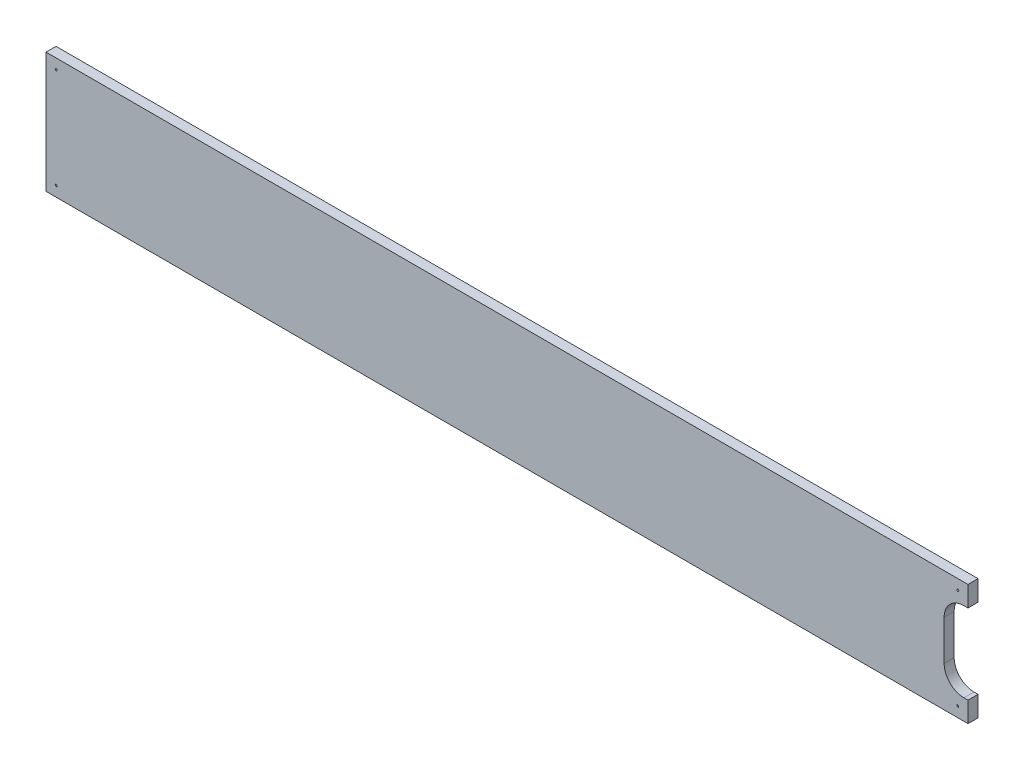
ISO-10303-21;
HEADER;
FILE_DESCRIPTION(('STEP AP214'),'2;1');
FILE_NAME('part.step','',(''),(''),'','','');
FILE_SCHEMA(('AUTOMOTIVE_DESIGN { 1 0 10303 214 1 1 1 1 }'));
ENDSEC;
DATA;
#1=APPLICATION_CONTEXT('core data for automotive mechanical design processes');
#2=APPLICATION_PROTOCOL_DEFINITION('international standard','automotive_design',2000,#1);
#3=PRODUCT_CONTEXT('',#1,'mechanical');
#4=PRODUCT('Part','Part','',(#3));
#5=PRODUCT_RELATED_PRODUCT_CATEGORY('part','',(#4));
#6=PRODUCT_DEFINITION_FORMATION('','',#4);
#7=PRODUCT_DEFINITION_CONTEXT('part definition',#1,'design');
#8=PRODUCT_DEFINITION('design','',#6,#7);
#9=PRODUCT_DEFINITION_SHAPE('','',#8);
#10=(LENGTH_UNIT() NAMED_UNIT(*) SI_UNIT(.MILLI.,.METRE.));
#11=(NAMED_UNIT(*) PLANE_ANGLE_UNIT() SI_UNIT($,.RADIAN.));
#12=(NAMED_UNIT(*) SI_UNIT($,.STERADIAN.) SOLID_ANGLE_UNIT());
#13=UNCERTAINTY_MEASURE_WITH_UNIT(LENGTH_MEASURE(1.E-05),#10,'distance_accuracy_value','');
#14=(GEOMETRIC_REPRESENTATION_CONTEXT(3) GLOBAL_UNCERTAINTY_ASSIGNED_CONTEXT((#13)) GLOBAL_UNIT_ASSIGNED_CONTEXT((#10,
#11,#12)) REPRESENTATION_CONTEXT('',''));
#15=CARTESIAN_POINT('',(0.,0.,0.));
#16=DIRECTION('',(0.,0.,1.));
#17=DIRECTION('',(1.,0.,0.));
#18=AXIS2_PLACEMENT_3D('',#15,#16,#17);
#19=CARTESIAN_POINT('',(460.1,-0.1,5.));
#20=DIRECTION('',(-1.,0.,0.));
#21=DIRECTION('',(0.,0.,1.));
#22=AXIS2_PLACEMENT_3D('',#19,#20,#21);
#23=PLANE('',#22);
#24=DIRECTION('',(0.,0.,1.));
#25=VECTOR('',#24,1.);
#26=CARTESIAN_POINT('',(460.1,10.1,-0.00100000000000013));
#27=LINE('',#26,#25);
#28=CARTESIAN_POINT('',(460.1,10.1,0.));
#29=VERTEX_POINT('',#28);
#30=CARTESIAN_POINT('',(460.1,10.1,5.));
#31=VERTEX_POINT('',#30);
#32=EDGE_CURVE('E55',#29,#31,#27,.T.);
#33=ORIENTED_EDGE('',*,*,#32,.T.);
#34=DIRECTION('',(0.,1.,0.));
#35=VECTOR('',#34,1.);
#36=CARTESIAN_POINT('',(460.1,-0.1,5.));
#37=LINE('',#36,#35);
#38=CARTESIAN_POINT('',(460.1,-0.1,5.));
#39=VERTEX_POINT('',#38);
#40=EDGE_CURVE('E232',#39,#31,#37,.T.);
#41=ORIENTED_EDGE('',*,*,#40,.F.);
#42=DIRECTION('',(0.,0.,-1.));
#43=VECTOR('',#42,1.);
#44=CARTESIAN_POINT('',(460.1,-0.1,5.));
#45=LINE('',#44,#43);
#46=CARTESIAN_POINT('',(460.1,-0.1,0.));
#47=VERTEX_POINT('',#46);
#48=EDGE_CURVE('E48',#39,#47,#45,.T.);
#49=ORIENTED_EDGE('',*,*,#48,.T.);
#50=DIRECTION('',(0.,1.,0.));
#51=VECTOR('',#50,1.);
#52=CARTESIAN_POINT('',(460.1,-0.1,0.));
#53=LINE('',#52,#51);
#54=EDGE_CURVE('E246',#47,#29,#53,.T.);
#55=ORIENTED_EDGE('',*,*,#54,.T.);
#56=EDGE_LOOP('',(#33,#41,#49,#55));
#57=FACE_BOUND('',#56,.T.);
#58=ADVANCED_FACE('F39',(#57),#23,.F.);
#59=CARTESIAN_POINT('',(-0.1,-0.1,5.));
#60=DIRECTION('',(1.,0.,0.));
#61=DIRECTION('',(0.,0.,-1.));
#62=AXIS2_PLACEMENT_3D('',#59,#60,#61);
#63=PLANE('',#62);
#64=DIRECTION('',(0.,-1.,0.));
#65=VECTOR('',#64,1.);
#66=CARTESIAN_POINT('',(-0.1,-0.1,0.));
#67=LINE('',#66,#65);
#68=CARTESIAN_POINT('',(-0.1,60.1,0.));
#69=VERTEX_POINT('',#68);
#70=CARTESIAN_POINT('',(-0.1,-0.1,0.));
#71=VERTEX_POINT('',#70);
#72=EDGE_CURVE('E225',#69,#71,#67,.T.);
#73=ORIENTED_EDGE('',*,*,#72,.T.);
#74=DIRECTION('',(0.,0.,-1.));
#75=VECTOR('',#74,1.);
#76=CARTESIAN_POINT('',(-0.1,-0.1,5.));
#77=LINE('',#76,#75);
#78=CARTESIAN_POINT('',(-0.1,-0.1,5.));
#79=VERTEX_POINT('',#78);
#80=EDGE_CURVE('E11',#79,#71,#77,.T.);
#81=ORIENTED_EDGE('',*,*,#80,.F.);
#82=DIRECTION('',(0.,-1.,0.));
#83=VECTOR('',#82,1.);
#84=CARTESIAN_POINT('',(-0.1,-0.1,5.));
#85=LINE('',#84,#83);
#86=CARTESIAN_POINT('',(-0.1,60.1,5.));
#87=VERTEX_POINT('',#86);
#88=EDGE_CURVE('E226',#87,#79,#85,.T.);
#89=ORIENTED_EDGE('',*,*,#88,.F.);
#90=DIRECTION('',(0.,0.,-1.));
#91=VECTOR('',#90,1.);
#92=CARTESIAN_POINT('',(-0.1,60.1,5.));
#93=LINE('',#92,#91);
#94=EDGE_CURVE('E238',#87,#69,#93,.T.);
#95=ORIENTED_EDGE('',*,*,#94,.T.);
#96=EDGE_LOOP('',(#73,#81,#89,#95));
#97=FACE_BOUND('',#96,.T.);
#98=ADVANCED_FACE('F41',(#97),#63,.F.);
#99=CARTESIAN_POINT('',(-0.1,-0.1,5.));
#100=DIRECTION('',(0.,1.,0.));
#101=DIRECTION('',(0.,0.,1.));
#102=AXIS2_PLACEMENT_3D('',#99,#100,#101);
#103=PLANE('',#102);
#104=DIRECTION('',(1.,0.,0.));
#105=VECTOR('',#104,1.);
#106=CARTESIAN_POINT('',(-0.1,-0.1,0.));
#107=LINE('',#106,#105);
#108=EDGE_CURVE('E242',#71,#47,#107,.T.);
#109=ORIENTED_EDGE('',*,*,#108,.T.);
#110=ORIENTED_EDGE('',*,*,#48,.F.);
#111=DIRECTION('',(1.,0.,0.));
#112=VECTOR('',#111,1.);
#113=CARTESIAN_POINT('',(-0.1,-0.1,5.));
#114=LINE('',#113,#112);
#115=EDGE_CURVE('E92',#79,#39,#114,.T.);
#116=ORIENTED_EDGE('',*,*,#115,.F.);
#117=ORIENTED_EDGE('',*,*,#80,.T.);
#118=EDGE_LOOP('',(#109,#110,#116,#117));
#119=FACE_BOUND('',#118,.T.);
#120=ADVANCED_FACE('F261',(#119),#103,.F.);
#121=CARTESIAN_POINT('',(460.1,49.9,5.));
#122=VERTEX_POINT('',#121);
#123=CARTESIAN_POINT('',(460.1,60.1,5.));
#124=VERTEX_POINT('',#123);
#125=EDGE_CURVE('E231',#122,#124,#37,.T.);
#126=ORIENTED_EDGE('',*,*,#125,.F.);
#127=DIRECTION('',(0.,0.,1.));
#128=VECTOR('',#127,1.);
#129=CARTESIAN_POINT('',(460.1,49.9,-0.00100000000000013));
#130=LINE('',#129,#128);
#131=CARTESIAN_POINT('',(460.1,49.9,0.));
#132=VERTEX_POINT('',#131);
#133=EDGE_CURVE('E189',#132,#122,#130,.T.);
#134=ORIENTED_EDGE('',*,*,#133,.F.);
#135=CARTESIAN_POINT('',(460.1,60.1,0.));
#136=VERTEX_POINT('',#135);
#137=EDGE_CURVE('E245',#132,#136,#53,.T.);
#138=ORIENTED_EDGE('',*,*,#137,.T.);
#139=DIRECTION('',(0.,0.,-1.));
#140=VECTOR('',#139,1.);
#141=CARTESIAN_POINT('',(460.1,60.1,5.));
#142=LINE('',#141,#140);
#143=EDGE_CURVE('E253',#124,#136,#142,.T.);
#144=ORIENTED_EDGE('',*,*,#143,.F.);
#145=EDGE_LOOP('',(#126,#134,#138,#144));
#146=FACE_BOUND('',#145,.T.);
#147=ADVANCED_FACE('F274',(#146),#23,.F.);
#148=CARTESIAN_POINT('',(-0.1,60.1,5.));
#149=DIRECTION('',(0.,-1.,0.));
#150=DIRECTION('',(0.,0.,-1.));
#151=AXIS2_PLACEMENT_3D('',#148,#149,#150);
#152=PLANE('',#151);
#153=DIRECTION('',(-1.,0.,0.));
#154=VECTOR('',#153,1.);
#155=CARTESIAN_POINT('',(-0.1,60.1,0.));
#156=LINE('',#155,#154);
#157=EDGE_CURVE('E85',#136,#69,#156,.T.);
#158=ORIENTED_EDGE('',*,*,#157,.T.);
#159=ORIENTED_EDGE('',*,*,#94,.F.);
#160=DIRECTION('',(-1.,0.,0.));
#161=VECTOR('',#160,1.);
#162=CARTESIAN_POINT('',(-0.1,60.1,5.));
#163=LINE('',#162,#161);
#164=EDGE_CURVE('E64',#124,#87,#163,.T.);
#165=ORIENTED_EDGE('',*,*,#164,.F.);
#166=ORIENTED_EDGE('',*,*,#143,.T.);
#167=EDGE_LOOP('',(#158,#159,#165,#166));
#168=FACE_BOUND('',#167,.T.);
#169=ADVANCED_FACE('F264',(#168),#152,.F.);
#170=CARTESIAN_POINT('',(0.,0.,5.));
#171=DIRECTION('',(0.,0.,-1.));
#172=DIRECTION('',(-1.,0.,0.));
#173=AXIS2_PLACEMENT_3D('',#170,#171,#172);
#174=PLANE('',#173);
#175=CARTESIAN_POINT('',(5.,55.,5.));
#176=DIRECTION('',(0.,0.,1.));
#177=DIRECTION('',(1.,0.,0.));
#178=AXIS2_PLACEMENT_3D('',#175,#176,#177);
#179=CIRCLE('',#178,0.5);
#180=CARTESIAN_POINT('',(5.5,55.,5.));
#181=VERTEX_POINT('',#180);
#182=EDGE_CURVE('E144',#181,#181,#179,.T.);
#183=ORIENTED_EDGE('',*,*,#182,.F.);
#184=EDGE_LOOP('',(#183));
#185=FACE_BOUND('',#184,.T.);
#186=CARTESIAN_POINT('',(5.,5.,5.));
#187=DIRECTION('',(0.,0.,1.));
#188=DIRECTION('',(1.,0.,0.));
#189=AXIS2_PLACEMENT_3D('',#186,#187,#188);
#190=CIRCLE('',#189,0.5);
#191=CARTESIAN_POINT('',(5.5,5.,5.));
#192=VERTEX_POINT('',#191);
#193=EDGE_CURVE('E201',#192,#192,#190,.T.);
#194=ORIENTED_EDGE('',*,*,#193,.F.);
#195=EDGE_LOOP('',(#194));
#196=FACE_BOUND('',#195,.T.);
#197=CARTESIAN_POINT('',(455.,5.,5.));
#198=DIRECTION('',(0.,0.,1.));
#199=DIRECTION('',(1.,0.,0.));
#200=AXIS2_PLACEMENT_3D('',#197,#198,#199);
#201=CIRCLE('',#200,0.5);
#202=CARTESIAN_POINT('',(455.5,5.,5.));
#203=VERTEX_POINT('',#202);
#204=EDGE_CURVE('E209',#203,#203,#201,.T.);
#205=ORIENTED_EDGE('',*,*,#204,.F.);
#206=EDGE_LOOP('',(#205));
#207=FACE_BOUND('',#206,.T.);
#208=CARTESIAN_POINT('',(455.,55.,5.));
#209=DIRECTION('',(0.,0.,1.));
#210=DIRECTION('',(1.,0.,0.));
#211=AXIS2_PLACEMENT_3D('',#208,#209,#210);
#212=CIRCLE('',#211,0.5);
#213=CARTESIAN_POINT('',(455.5,55.,5.));
#214=VERTEX_POINT('',#213);
#215=EDGE_CURVE('E217',#214,#214,#212,.T.);
#216=ORIENTED_EDGE('',*,*,#215,.F.);
#217=EDGE_LOOP('',(#216));
#218=FACE_BOUND('',#217,.T.);
#219=CARTESIAN_POINT('',(458.1,40.,5.));
#220=DIRECTION('',(0.,0.,1.));
#221=DIRECTION('',(1.,0.,0.));
#222=AXIS2_PLACEMENT_3D('',#219,#220,#221);
#223=CIRCLE('',#222,9.90000000000001);
#224=CARTESIAN_POINT('',(448.2,40.,5.));
#225=VERTEX_POINT('',#224);
#226=CARTESIAN_POINT('',(458.1,49.9,5.));
#227=VERTEX_POINT('',#226);
#228=EDGE_CURVE('E174',#225,#227,#223,.F.);
#229=ORIENTED_EDGE('',*,*,#228,.T.);
#230=DIRECTION('',(-1.,0.,0.));
#231=VECTOR('',#230,1.);
#232=CARTESIAN_POINT('',(0.,49.9,5.));
#233=LINE('',#232,#231);
#234=EDGE_CURVE('E170',#122,#227,#233,.T.);
#235=ORIENTED_EDGE('',*,*,#234,.F.);
#236=ORIENTED_EDGE('',*,*,#125,.T.);
#237=ORIENTED_EDGE('',*,*,#164,.T.);
#238=ORIENTED_EDGE('',*,*,#88,.T.);
#239=ORIENTED_EDGE('',*,*,#115,.T.);
#240=ORIENTED_EDGE('',*,*,#40,.T.);
#241=DIRECTION('',(-1.,0.,0.));
#242=VECTOR('',#241,1.);
#243=CARTESIAN_POINT('',(0.,10.0999999999984,5.));
#244=LINE('',#243,#242);
#245=CARTESIAN_POINT('',(458.1,10.1,5.));
#246=VERTEX_POINT('',#245);
#247=EDGE_CURVE('E167',#31,#246,#244,.T.);
#248=ORIENTED_EDGE('',*,*,#247,.T.);
#249=CARTESIAN_POINT('',(458.1,20.,5.));
#250=DIRECTION('',(0.,0.,1.));
#251=DIRECTION('',(1.,0.,0.));
#252=AXIS2_PLACEMENT_3D('',#249,#250,#251);
#253=CIRCLE('',#252,9.90000000000001);
#254=CARTESIAN_POINT('',(448.2,20.,5.));
#255=VERTEX_POINT('',#254);
#256=EDGE_CURVE('E133',#246,#255,#253,.F.);
#257=ORIENTED_EDGE('',*,*,#256,.T.);
#258=DIRECTION('',(0.,-1.,0.));
#259=VECTOR('',#258,1.);
#260=CARTESIAN_POINT('',(448.2,0.,5.));
#261=LINE('',#260,#259);
#262=EDGE_CURVE('E136',#225,#255,#261,.T.);
#263=ORIENTED_EDGE('',*,*,#262,.F.);
#264=EDGE_LOOP('',(#229,#235,#236,#237,#238,#239,#240,#248,#257,#263));
#265=FACE_BOUND('',#264,.T.);
#266=ADVANCED_FACE('F273',(#185,#196,#207,#218,#265),#174,.F.);
#267=CARTESIAN_POINT('',(0.,0.,0.));
#268=DIRECTION('',(0.,0.,-1.));
#269=DIRECTION('',(-1.,0.,0.));
#270=AXIS2_PLACEMENT_3D('',#267,#268,#269);
#271=PLANE('',#270);
#272=DIRECTION('',(-1.,0.,0.));
#273=VECTOR('',#272,1.);
#274=CARTESIAN_POINT('',(0.,49.9,0.));
#275=LINE('',#274,#273);
#276=CARTESIAN_POINT('',(458.1,49.9,0.));
#277=VERTEX_POINT('',#276);
#278=EDGE_CURVE('E162',#132,#277,#275,.T.);
#279=ORIENTED_EDGE('',*,*,#278,.T.);
#280=CARTESIAN_POINT('',(458.1,40.,0.));
#281=DIRECTION('',(0.,0.,-1.));
#282=DIRECTION('',(-1.,0.,0.));
#283=AXIS2_PLACEMENT_3D('',#280,#281,#282);
#284=CIRCLE('',#283,9.90000000000001);
#285=CARTESIAN_POINT('',(448.2,40.,0.));
#286=VERTEX_POINT('',#285);
#287=EDGE_CURVE('E156',#286,#277,#284,.T.);
#288=ORIENTED_EDGE('',*,*,#287,.F.);
#289=DIRECTION('',(0.,-1.,0.));
#290=VECTOR('',#289,1.);
#291=CARTESIAN_POINT('',(448.2,0.,0.));
#292=LINE('',#291,#290);
#293=CARTESIAN_POINT('',(448.2,20.,0.));
#294=VERTEX_POINT('',#293);
#295=EDGE_CURVE('E152',#286,#294,#292,.T.);
#296=ORIENTED_EDGE('',*,*,#295,.T.);
#297=CARTESIAN_POINT('',(458.1,20.,0.));
#298=DIRECTION('',(0.,0.,-1.));
#299=DIRECTION('',(-1.,0.,0.));
#300=AXIS2_PLACEMENT_3D('',#297,#298,#299);
#301=CIRCLE('',#300,9.90000000000001);
#302=CARTESIAN_POINT('',(458.1,10.1,0.));
#303=VERTEX_POINT('',#302);
#304=EDGE_CURVE('E130',#303,#294,#301,.T.);
#305=ORIENTED_EDGE('',*,*,#304,.F.);
#306=DIRECTION('',(-1.,0.,0.));
#307=VECTOR('',#306,1.);
#308=CARTESIAN_POINT('',(0.,10.0999999999984,0.));
#309=LINE('',#308,#307);
#310=EDGE_CURVE('E138',#29,#303,#309,.T.);
#311=ORIENTED_EDGE('',*,*,#310,.F.);
#312=ORIENTED_EDGE('',*,*,#54,.F.);
#313=ORIENTED_EDGE('',*,*,#108,.F.);
#314=ORIENTED_EDGE('',*,*,#72,.F.);
#315=ORIENTED_EDGE('',*,*,#157,.F.);
#316=ORIENTED_EDGE('',*,*,#137,.F.);
#317=EDGE_LOOP('',(#279,#288,#296,#305,#311,#312,#313,#314,#315,#316));
#318=FACE_BOUND('',#317,.T.);
#319=CARTESIAN_POINT('',(5.,55.,0.));
#320=DIRECTION('',(0.,0.,1.));
#321=DIRECTION('',(1.,0.,0.));
#322=AXIS2_PLACEMENT_3D('',#319,#320,#321);
#323=CIRCLE('',#322,0.499999999999999);
#324=CARTESIAN_POINT('',(5.5,55.,0.));
#325=VERTEX_POINT('',#324);
#326=EDGE_CURVE('E197',#325,#325,#323,.T.);
#327=ORIENTED_EDGE('',*,*,#326,.T.);
#328=EDGE_LOOP('',(#327));
#329=FACE_BOUND('',#328,.T.);
#330=CARTESIAN_POINT('',(5.,5.,0.));
#331=DIRECTION('',(0.,0.,1.));
#332=DIRECTION('',(1.,0.,0.));
#333=AXIS2_PLACEMENT_3D('',#330,#331,#332);
#334=CIRCLE('',#333,0.499999999999999);
#335=CARTESIAN_POINT('',(5.5,5.,0.));
#336=VERTEX_POINT('',#335);
#337=EDGE_CURVE('E205',#336,#336,#334,.T.);
#338=ORIENTED_EDGE('',*,*,#337,.T.);
#339=EDGE_LOOP('',(#338));
#340=FACE_BOUND('',#339,.T.);
#341=CARTESIAN_POINT('',(455.,5.,0.));
#342=DIRECTION('',(0.,0.,1.));
#343=DIRECTION('',(1.,0.,0.));
#344=AXIS2_PLACEMENT_3D('',#341,#342,#343);
#345=CIRCLE('',#344,0.5);
#346=CARTESIAN_POINT('',(455.5,5.,0.));
#347=VERTEX_POINT('',#346);
#348=EDGE_CURVE('E213',#347,#347,#345,.T.);
#349=ORIENTED_EDGE('',*,*,#348,.T.);
#350=EDGE_LOOP('',(#349));
#351=FACE_BOUND('',#350,.T.);
#352=CARTESIAN_POINT('',(455.,55.,0.));
#353=DIRECTION('',(0.,0.,1.));
#354=DIRECTION('',(1.,0.,0.));
#355=AXIS2_PLACEMENT_3D('',#352,#353,#354);
#356=CIRCLE('',#355,0.5);
#357=CARTESIAN_POINT('',(455.5,55.,0.));
#358=VERTEX_POINT('',#357);
#359=EDGE_CURVE('E221',#358,#358,#356,.T.);
#360=ORIENTED_EDGE('',*,*,#359,.T.);
#361=EDGE_LOOP('',(#360));
#362=FACE_BOUND('',#361,.T.);
#363=ADVANCED_FACE('F148',(#318,#329,#340,#351,#362),#271,.T.);
#364=CARTESIAN_POINT('',(455.,55.,5.));
#365=DIRECTION('',(0.,0.,1.));
#366=DIRECTION('',(1.,0.,0.));
#367=AXIS2_PLACEMENT_3D('',#364,#365,#366);
#368=CYLINDRICAL_SURFACE('',#367,0.5);
#369=ORIENTED_EDGE('',*,*,#359,.F.);
#370=EDGE_LOOP('',(#369));
#371=FACE_BOUND('',#370,.T.);
#372=ORIENTED_EDGE('',*,*,#215,.T.);
#373=EDGE_LOOP('',(#372));
#374=FACE_BOUND('',#373,.T.);
#375=ADVANCED_FACE('F339',(#371,#374),#368,.F.);
#376=CARTESIAN_POINT('',(455.,5.,5.));
#377=DIRECTION('',(0.,0.,1.));
#378=DIRECTION('',(1.,0.,0.));
#379=AXIS2_PLACEMENT_3D('',#376,#377,#378);
#380=CYLINDRICAL_SURFACE('',#379,0.5);
#381=ORIENTED_EDGE('',*,*,#348,.F.);
#382=EDGE_LOOP('',(#381));
#383=FACE_BOUND('',#382,.T.);
#384=ORIENTED_EDGE('',*,*,#204,.T.);
#385=EDGE_LOOP('',(#384));
#386=FACE_BOUND('',#385,.T.);
#387=ADVANCED_FACE('F347',(#383,#386),#380,.F.);
#388=CARTESIAN_POINT('',(5.,5.,5.));
#389=DIRECTION('',(0.,0.,1.));
#390=DIRECTION('',(1.,0.,0.));
#391=AXIS2_PLACEMENT_3D('',#388,#389,#390);
#392=CYLINDRICAL_SURFACE('',#391,0.499999999999999);
#393=ORIENTED_EDGE('',*,*,#337,.F.);
#394=EDGE_LOOP('',(#393));
#395=FACE_BOUND('',#394,.T.);
#396=ORIENTED_EDGE('',*,*,#193,.T.);
#397=EDGE_LOOP('',(#396));
#398=FACE_BOUND('',#397,.T.);
#399=ADVANCED_FACE('F356',(#395,#398),#392,.F.);
#400=CARTESIAN_POINT('',(5.,55.,5.));
#401=DIRECTION('',(0.,0.,1.));
#402=DIRECTION('',(1.,0.,0.));
#403=AXIS2_PLACEMENT_3D('',#400,#401,#402);
#404=CYLINDRICAL_SURFACE('',#403,0.499999999999999);
#405=ORIENTED_EDGE('',*,*,#326,.F.);
#406=EDGE_LOOP('',(#405));
#407=FACE_BOUND('',#406,.T.);
#408=ORIENTED_EDGE('',*,*,#182,.T.);
#409=EDGE_LOOP('',(#408));
#410=FACE_BOUND('',#409,.T.);
#411=ADVANCED_FACE('F290',(#407,#410),#404,.F.);
#412=CARTESIAN_POINT('',(458.1,20.,-0.00100000000000013));
#413=DIRECTION('',(0.,0.,1.));
#414=DIRECTION('',(1.,0.,0.));
#415=AXIS2_PLACEMENT_3D('',#412,#413,#414);
#416=CYLINDRICAL_SURFACE('',#415,9.90000000000001);
#417=ORIENTED_EDGE('',*,*,#304,.T.);
#418=DIRECTION('',(0.,0.,1.));
#419=VECTOR('',#418,1.);
#420=CARTESIAN_POINT('',(448.2,20.,-0.00100000000000013));
#421=LINE('',#420,#419);
#422=EDGE_CURVE('E145',#294,#255,#421,.T.);
#423=ORIENTED_EDGE('',*,*,#422,.T.);
#424=ORIENTED_EDGE('',*,*,#256,.F.);
#425=DIRECTION('',(0.,0.,1.));
#426=VECTOR('',#425,1.);
#427=CARTESIAN_POINT('',(458.1,10.1,-0.00100000000000013));
#428=LINE('',#427,#426);
#429=EDGE_CURVE('E127',#303,#246,#428,.T.);
#430=ORIENTED_EDGE('',*,*,#429,.F.);
#431=EDGE_LOOP('',(#417,#423,#424,#430));
#432=FACE_BOUND('',#431,.T.);
#433=ADVANCED_FACE('F128',(#432),#416,.F.);
#434=CARTESIAN_POINT('',(448.2,0.,-0.00100000000000013));
#435=DIRECTION('',(-1.,0.,0.));
#436=DIRECTION('',(0.,0.,1.));
#437=AXIS2_PLACEMENT_3D('',#434,#435,#436);
#438=PLANE('',#437);
#439=DIRECTION('',(0.,0.,1.));
#440=VECTOR('',#439,1.);
#441=CARTESIAN_POINT('',(448.2,40.,-0.00100000000000013));
#442=LINE('',#441,#440);
#443=EDGE_CURVE('E183',#286,#225,#442,.T.);
#444=ORIENTED_EDGE('',*,*,#443,.T.);
#445=ORIENTED_EDGE('',*,*,#262,.T.);
#446=ORIENTED_EDGE('',*,*,#422,.F.);
#447=ORIENTED_EDGE('',*,*,#295,.F.);
#448=EDGE_LOOP('',(#444,#445,#446,#447));
#449=FACE_BOUND('',#448,.T.);
#450=ADVANCED_FACE('F282',(#449),#438,.F.);
#451=CARTESIAN_POINT('',(458.1,40.,-0.00100000000000013));
#452=DIRECTION('',(0.,0.,1.));
#453=DIRECTION('',(1.,0.,0.));
#454=AXIS2_PLACEMENT_3D('',#451,#452,#453);
#455=CYLINDRICAL_SURFACE('',#454,9.90000000000001);
#456=ORIENTED_EDGE('',*,*,#287,.T.);
#457=DIRECTION('',(0.,0.,1.));
#458=VECTOR('',#457,1.);
#459=CARTESIAN_POINT('',(458.1,49.9,-0.00100000000000013));
#460=LINE('',#459,#458);
#461=EDGE_CURVE('E186',#277,#227,#460,.T.);
#462=ORIENTED_EDGE('',*,*,#461,.T.);
#463=ORIENTED_EDGE('',*,*,#228,.F.);
#464=ORIENTED_EDGE('',*,*,#443,.F.);
#465=EDGE_LOOP('',(#456,#462,#463,#464));
#466=FACE_BOUND('',#465,.T.);
#467=ADVANCED_FACE('F279',(#466),#455,.F.);
#468=CARTESIAN_POINT('',(0.,49.9,-0.00100000000000013));
#469=DIRECTION('',(0.,1.,0.));
#470=DIRECTION('',(0.,0.,1.));
#471=AXIS2_PLACEMENT_3D('',#468,#469,#470);
#472=PLANE('',#471);
#473=ORIENTED_EDGE('',*,*,#133,.T.);
#474=ORIENTED_EDGE('',*,*,#234,.T.);
#475=ORIENTED_EDGE('',*,*,#461,.F.);
#476=ORIENTED_EDGE('',*,*,#278,.F.);
#477=EDGE_LOOP('',(#473,#474,#475,#476));
#478=FACE_BOUND('',#477,.T.);
#479=ADVANCED_FACE('F276',(#478),#472,.F.);
#480=CARTESIAN_POINT('',(0.,10.0999999999984,-0.00100000000000013));
#481=DIRECTION('',(0.,1.,0.));
#482=DIRECTION('',(-1.,0.,0.));
#483=AXIS2_PLACEMENT_3D('',#480,#481,#482);
#484=PLANE('',#483);
#485=ORIENTED_EDGE('',*,*,#310,.T.);
#486=ORIENTED_EDGE('',*,*,#429,.T.);
#487=ORIENTED_EDGE('',*,*,#247,.F.);
#488=ORIENTED_EDGE('',*,*,#32,.F.);
#489=EDGE_LOOP('',(#485,#486,#487,#488));
#490=FACE_BOUND('',#489,.T.);
#491=ADVANCED_FACE('F139',(#490),#484,.T.);
#492=CLOSED_SHELL('',(#58,#98,#120,#147,#169,#266,#363,#375,#387,#399,#411,#433,#450,#467,#479,#491));
#493=MANIFOLD_SOLID_BREP('B2',#492);
#494=ADVANCED_BREP_SHAPE_REPRESENTATION('',(#18,#493),#14);
#495=SHAPE_DEFINITION_REPRESENTATION(#9,#494);
ENDSEC;
END-ISO-10303-21;
